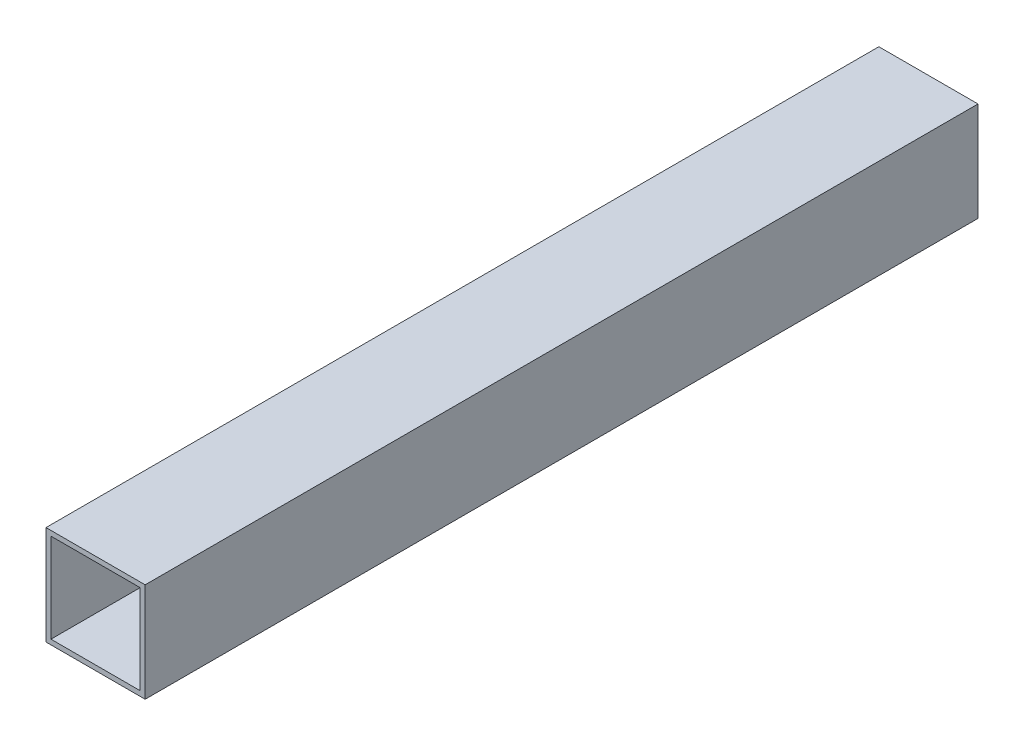
ISO-10303-21;
HEADER;
FILE_DESCRIPTION(('STEP AP214'),'2;1');
FILE_NAME('part.step','',(''),(''),'','','');
FILE_SCHEMA(('AUTOMOTIVE_DESIGN { 1 0 10303 214 1 1 1 1 }'));
ENDSEC;
DATA;
#1=APPLICATION_CONTEXT('core data for automotive mechanical design processes');
#2=APPLICATION_PROTOCOL_DEFINITION('international standard','automotive_design',2000,#1);
#3=PRODUCT_CONTEXT('',#1,'mechanical');
#4=PRODUCT('Part','Part','',(#3));
#5=PRODUCT_RELATED_PRODUCT_CATEGORY('part','',(#4));
#6=PRODUCT_DEFINITION_FORMATION('','',#4);
#7=PRODUCT_DEFINITION_CONTEXT('part definition',#1,'design');
#8=PRODUCT_DEFINITION('design','',#6,#7);
#9=PRODUCT_DEFINITION_SHAPE('','',#8);
#10=(LENGTH_UNIT() NAMED_UNIT(*) SI_UNIT(.MILLI.,.METRE.));
#11=(NAMED_UNIT(*) PLANE_ANGLE_UNIT() SI_UNIT($,.RADIAN.));
#12=(NAMED_UNIT(*) SI_UNIT($,.STERADIAN.) SOLID_ANGLE_UNIT());
#13=UNCERTAINTY_MEASURE_WITH_UNIT(LENGTH_MEASURE(1.E-05),#10,'distance_accuracy_value','');
#14=(GEOMETRIC_REPRESENTATION_CONTEXT(3) GLOBAL_UNCERTAINTY_ASSIGNED_CONTEXT((#13)) GLOBAL_UNIT_ASSIGNED_CONTEXT((#10,
#11,#12)) REPRESENTATION_CONTEXT('',''));
#15=CARTESIAN_POINT('',(0.,0.,0.));
#16=DIRECTION('',(0.,0.,1.));
#17=DIRECTION('',(1.,0.,0.));
#18=AXIS2_PLACEMENT_3D('',#15,#16,#17);
#19=CARTESIAN_POINT('',(0.,0.,420.));
#20=DIRECTION('',(0.,0.,-1.));
#21=DIRECTION('',(-1.,0.,0.));
#22=AXIS2_PLACEMENT_3D('',#19,#20,#21);
#23=PLANE('',#22);
#24=DIRECTION('',(0.,-1.,0.));
#25=VECTOR('',#24,1.);
#26=CARTESIAN_POINT('',(-50.,-50.,420.));
#27=LINE('',#26,#25);
#28=CARTESIAN_POINT('',(-50.,49.9999999999999,420.));
#29=VERTEX_POINT('',#28);
#30=CARTESIAN_POINT('',(-50.,-50.,420.));
#31=VERTEX_POINT('',#30);
#32=EDGE_CURVE('E134',#29,#31,#27,.T.);
#33=ORIENTED_EDGE('',*,*,#32,.T.);
#34=DIRECTION('',(1.,0.,0.));
#35=VECTOR('',#34,1.);
#36=CARTESIAN_POINT('',(-50.,-50.,420.));
#37=LINE('',#36,#35);
#38=CARTESIAN_POINT('',(50.,-50.,420.));
#39=VERTEX_POINT('',#38);
#40=EDGE_CURVE('E137',#31,#39,#37,.T.);
#41=ORIENTED_EDGE('',*,*,#40,.T.);
#42=DIRECTION('',(0.,1.,0.));
#43=VECTOR('',#42,1.);
#44=CARTESIAN_POINT('',(50.,-50.,420.));
#45=LINE('',#44,#43);
#46=CARTESIAN_POINT('',(49.9999999999999,49.9999999999999,420.));
#47=VERTEX_POINT('',#46);
#48=EDGE_CURVE('E140',#39,#47,#45,.T.);
#49=ORIENTED_EDGE('',*,*,#48,.T.);
#50=DIRECTION('',(-1.,0.,0.));
#51=VECTOR('',#50,1.);
#52=CARTESIAN_POINT('',(-50.,49.9999999999999,420.));
#53=LINE('',#52,#51);
#54=EDGE_CURVE('E142',#47,#29,#53,.T.);
#55=ORIENTED_EDGE('',*,*,#54,.T.);
#56=EDGE_LOOP('',(#33,#41,#49,#55));
#57=FACE_BOUND('',#56,.T.);
#58=DIRECTION('',(0.,-1.,0.));
#59=VECTOR('',#58,1.);
#60=CARTESIAN_POINT('',(-45.,-45.,420.));
#61=LINE('',#60,#59);
#62=CARTESIAN_POINT('',(-45.,44.9999999999999,420.));
#63=VERTEX_POINT('',#62);
#64=CARTESIAN_POINT('',(-45.,-45.,420.));
#65=VERTEX_POINT('',#64);
#66=EDGE_CURVE('E98',#63,#65,#61,.T.);
#67=ORIENTED_EDGE('',*,*,#66,.F.);
#68=DIRECTION('',(-1.,0.,0.));
#69=VECTOR('',#68,1.);
#70=CARTESIAN_POINT('',(-45.,44.9999999999999,420.));
#71=LINE('',#70,#69);
#72=CARTESIAN_POINT('',(45.,44.9999999999999,420.));
#73=VERTEX_POINT('',#72);
#74=EDGE_CURVE('E120',#73,#63,#71,.T.);
#75=ORIENTED_EDGE('',*,*,#74,.F.);
#76=DIRECTION('',(0.,1.,0.));
#77=VECTOR('',#76,1.);
#78=CARTESIAN_POINT('',(45.,-45.,420.));
#79=LINE('',#78,#77);
#80=CARTESIAN_POINT('',(45.,-45.,420.));
#81=VERTEX_POINT('',#80);
#82=EDGE_CURVE('E118',#81,#73,#79,.T.);
#83=ORIENTED_EDGE('',*,*,#82,.F.);
#84=DIRECTION('',(1.,0.,0.));
#85=VECTOR('',#84,1.);
#86=CARTESIAN_POINT('',(-45.,-45.,420.));
#87=LINE('',#86,#85);
#88=EDGE_CURVE('E106',#65,#81,#87,.T.);
#89=ORIENTED_EDGE('',*,*,#88,.F.);
#90=EDGE_LOOP('',(#67,#75,#83,#89));
#91=FACE_BOUND('',#90,.T.);
#92=ADVANCED_FACE('F33',(#57,#91),#23,.F.);
#93=CARTESIAN_POINT('',(0.,0.,-420.));
#94=DIRECTION('',(0.,0.,-1.));
#95=DIRECTION('',(-1.,0.,0.));
#96=AXIS2_PLACEMENT_3D('',#93,#94,#95);
#97=PLANE('',#96);
#98=DIRECTION('',(0.,-1.,0.));
#99=VECTOR('',#98,1.);
#100=CARTESIAN_POINT('',(-50.,-50.,-420.));
#101=LINE('',#100,#99);
#102=CARTESIAN_POINT('',(-50.,49.9999999999999,-420.));
#103=VERTEX_POINT('',#102);
#104=CARTESIAN_POINT('',(-50.,-50.,-420.));
#105=VERTEX_POINT('',#104);
#106=EDGE_CURVE('E114',#103,#105,#101,.T.);
#107=ORIENTED_EDGE('',*,*,#106,.F.);
#108=DIRECTION('',(-1.,0.,0.));
#109=VECTOR('',#108,1.);
#110=CARTESIAN_POINT('',(-50.,49.9999999999999,-420.));
#111=LINE('',#110,#109);
#112=CARTESIAN_POINT('',(49.9999999999999,49.9999999999999,-420.));
#113=VERTEX_POINT('',#112);
#114=EDGE_CURVE('E138',#113,#103,#111,.T.);
#115=ORIENTED_EDGE('',*,*,#114,.F.);
#116=DIRECTION('',(0.,1.,0.));
#117=VECTOR('',#116,1.);
#118=CARTESIAN_POINT('',(50.,-50.,-420.));
#119=LINE('',#118,#117);
#120=CARTESIAN_POINT('',(50.,-50.,-420.));
#121=VERTEX_POINT('',#120);
#122=EDGE_CURVE('E149',#121,#113,#119,.T.);
#123=ORIENTED_EDGE('',*,*,#122,.F.);
#124=DIRECTION('',(1.,0.,0.));
#125=VECTOR('',#124,1.);
#126=CARTESIAN_POINT('',(-50.,-50.,-420.));
#127=LINE('',#126,#125);
#128=EDGE_CURVE('E147',#105,#121,#127,.T.);
#129=ORIENTED_EDGE('',*,*,#128,.F.);
#130=EDGE_LOOP('',(#107,#115,#123,#129));
#131=FACE_BOUND('',#130,.T.);
#132=DIRECTION('',(-1.,0.,0.));
#133=VECTOR('',#132,1.);
#134=CARTESIAN_POINT('',(-45.,44.9999999999999,-420.));
#135=LINE('',#134,#133);
#136=CARTESIAN_POINT('',(45.,44.9999999999999,-420.));
#137=VERTEX_POINT('',#136);
#138=CARTESIAN_POINT('',(-45.,44.9999999999999,-420.));
#139=VERTEX_POINT('',#138);
#140=EDGE_CURVE('E107',#137,#139,#135,.T.);
#141=ORIENTED_EDGE('',*,*,#140,.T.);
#142=DIRECTION('',(0.,-1.,0.));
#143=VECTOR('',#142,1.);
#144=CARTESIAN_POINT('',(-45.,-45.,-420.));
#145=LINE('',#144,#143);
#146=CARTESIAN_POINT('',(-45.,-45.,-420.));
#147=VERTEX_POINT('',#146);
#148=EDGE_CURVE('E56',#139,#147,#145,.T.);
#149=ORIENTED_EDGE('',*,*,#148,.T.);
#150=DIRECTION('',(1.,0.,0.));
#151=VECTOR('',#150,1.);
#152=CARTESIAN_POINT('',(-45.,-45.,-420.));
#153=LINE('',#152,#151);
#154=CARTESIAN_POINT('',(45.,-45.,-420.));
#155=VERTEX_POINT('',#154);
#156=EDGE_CURVE('E113',#147,#155,#153,.T.);
#157=ORIENTED_EDGE('',*,*,#156,.T.);
#158=DIRECTION('',(0.,1.,0.));
#159=VECTOR('',#158,1.);
#160=CARTESIAN_POINT('',(45.,-45.,-420.));
#161=LINE('',#160,#159);
#162=EDGE_CURVE('E126',#155,#137,#161,.T.);
#163=ORIENTED_EDGE('',*,*,#162,.T.);
#164=EDGE_LOOP('',(#141,#149,#157,#163));
#165=FACE_BOUND('',#164,.T.);
#166=ADVANCED_FACE('F167',(#131,#165),#97,.T.);
#167=CARTESIAN_POINT('',(-50.,-50.,420.));
#168=DIRECTION('',(1.,0.,0.));
#169=DIRECTION('',(0.,0.,-1.));
#170=AXIS2_PLACEMENT_3D('',#167,#168,#169);
#171=PLANE('',#170);
#172=ORIENTED_EDGE('',*,*,#106,.T.);
#173=DIRECTION('',(0.,0.,-1.));
#174=VECTOR('',#173,1.);
#175=CARTESIAN_POINT('',(-50.,-50.,420.));
#176=LINE('',#175,#174);
#177=EDGE_CURVE('E11',#31,#105,#176,.T.);
#178=ORIENTED_EDGE('',*,*,#177,.F.);
#179=ORIENTED_EDGE('',*,*,#32,.F.);
#180=DIRECTION('',(0.,0.,-1.));
#181=VECTOR('',#180,1.);
#182=CARTESIAN_POINT('',(-50.,49.9999999999999,420.));
#183=LINE('',#182,#181);
#184=EDGE_CURVE('E144',#29,#103,#183,.T.);
#185=ORIENTED_EDGE('',*,*,#184,.T.);
#186=EDGE_LOOP('',(#172,#178,#179,#185));
#187=FACE_BOUND('',#186,.T.);
#188=ADVANCED_FACE('F35',(#187),#171,.F.);
#189=CARTESIAN_POINT('',(-50.,-50.,420.));
#190=DIRECTION('',(0.,1.,0.));
#191=DIRECTION('',(0.,0.,1.));
#192=AXIS2_PLACEMENT_3D('',#189,#190,#191);
#193=PLANE('',#192);
#194=ORIENTED_EDGE('',*,*,#128,.T.);
#195=DIRECTION('',(0.,0.,-1.));
#196=VECTOR('',#195,1.);
#197=CARTESIAN_POINT('',(50.,-50.,420.));
#198=LINE('',#197,#196);
#199=EDGE_CURVE('E41',#39,#121,#198,.T.);
#200=ORIENTED_EDGE('',*,*,#199,.F.);
#201=ORIENTED_EDGE('',*,*,#40,.F.);
#202=ORIENTED_EDGE('',*,*,#177,.T.);
#203=EDGE_LOOP('',(#194,#200,#201,#202));
#204=FACE_BOUND('',#203,.T.);
#205=ADVANCED_FACE('F177',(#204),#193,.F.);
#206=CARTESIAN_POINT('',(50.,-50.,420.));
#207=DIRECTION('',(-1.,0.,0.));
#208=DIRECTION('',(0.,-1.,0.));
#209=AXIS2_PLACEMENT_3D('',#206,#207,#208);
#210=PLANE('',#209);
#211=ORIENTED_EDGE('',*,*,#122,.T.);
#212=DIRECTION('',(0.,0.,-1.));
#213=VECTOR('',#212,1.);
#214=CARTESIAN_POINT('',(49.9999999999999,49.9999999999999,420.));
#215=LINE('',#214,#213);
#216=EDGE_CURVE('E154',#47,#113,#215,.T.);
#217=ORIENTED_EDGE('',*,*,#216,.F.);
#218=ORIENTED_EDGE('',*,*,#48,.F.);
#219=ORIENTED_EDGE('',*,*,#199,.T.);
#220=EDGE_LOOP('',(#211,#217,#218,#219));
#221=FACE_BOUND('',#220,.T.);
#222=ADVANCED_FACE('F161',(#221),#210,.F.);
#223=CARTESIAN_POINT('',(-50.,49.9999999999999,420.));
#224=DIRECTION('',(0.,-1.,0.));
#225=DIRECTION('',(0.,0.,-1.));
#226=AXIS2_PLACEMENT_3D('',#223,#224,#225);
#227=PLANE('',#226);
#228=ORIENTED_EDGE('',*,*,#114,.T.);
#229=ORIENTED_EDGE('',*,*,#184,.F.);
#230=ORIENTED_EDGE('',*,*,#54,.F.);
#231=ORIENTED_EDGE('',*,*,#216,.T.);
#232=EDGE_LOOP('',(#228,#229,#230,#231));
#233=FACE_BOUND('',#232,.T.);
#234=ADVANCED_FACE('F171',(#233),#227,.F.);
#235=CARTESIAN_POINT('',(-45.,-45.,420.));
#236=DIRECTION('',(1.,0.,0.));
#237=DIRECTION('',(0.,0.,-1.));
#238=AXIS2_PLACEMENT_3D('',#235,#236,#237);
#239=PLANE('',#238);
#240=ORIENTED_EDGE('',*,*,#148,.F.);
#241=DIRECTION('',(0.,0.,-1.));
#242=VECTOR('',#241,1.);
#243=CARTESIAN_POINT('',(-45.,44.9999999999999,420.));
#244=LINE('',#243,#242);
#245=EDGE_CURVE('E102',#63,#139,#244,.T.);
#246=ORIENTED_EDGE('',*,*,#245,.F.);
#247=ORIENTED_EDGE('',*,*,#66,.T.);
#248=DIRECTION('',(0.,0.,-1.));
#249=VECTOR('',#248,1.);
#250=CARTESIAN_POINT('',(-45.,-45.,420.));
#251=LINE('',#250,#249);
#252=EDGE_CURVE('E101',#65,#147,#251,.T.);
#253=ORIENTED_EDGE('',*,*,#252,.T.);
#254=EDGE_LOOP('',(#240,#246,#247,#253));
#255=FACE_BOUND('',#254,.T.);
#256=ADVANCED_FACE('F100',(#255),#239,.T.);
#257=CARTESIAN_POINT('',(-45.,-45.,420.));
#258=DIRECTION('',(0.,1.,0.));
#259=DIRECTION('',(0.,0.,1.));
#260=AXIS2_PLACEMENT_3D('',#257,#258,#259);
#261=PLANE('',#260);
#262=ORIENTED_EDGE('',*,*,#156,.F.);
#263=ORIENTED_EDGE('',*,*,#252,.F.);
#264=ORIENTED_EDGE('',*,*,#88,.T.);
#265=DIRECTION('',(0.,0.,-1.));
#266=VECTOR('',#265,1.);
#267=CARTESIAN_POINT('',(45.,-45.,420.));
#268=LINE('',#267,#266);
#269=EDGE_CURVE('E115',#81,#155,#268,.T.);
#270=ORIENTED_EDGE('',*,*,#269,.T.);
#271=EDGE_LOOP('',(#262,#263,#264,#270));
#272=FACE_BOUND('',#271,.T.);
#273=ADVANCED_FACE('F110',(#272),#261,.T.);
#274=CARTESIAN_POINT('',(45.,-45.,420.));
#275=DIRECTION('',(-1.,0.,0.));
#276=DIRECTION('',(0.,-1.,0.));
#277=AXIS2_PLACEMENT_3D('',#274,#275,#276);
#278=PLANE('',#277);
#279=ORIENTED_EDGE('',*,*,#162,.F.);
#280=ORIENTED_EDGE('',*,*,#269,.F.);
#281=ORIENTED_EDGE('',*,*,#82,.T.);
#282=DIRECTION('',(0.,0.,-1.));
#283=VECTOR('',#282,1.);
#284=CARTESIAN_POINT('',(45.,44.9999999999999,420.));
#285=LINE('',#284,#283);
#286=EDGE_CURVE('E48',#73,#137,#285,.T.);
#287=ORIENTED_EDGE('',*,*,#286,.T.);
#288=EDGE_LOOP('',(#279,#280,#281,#287));
#289=FACE_BOUND('',#288,.T.);
#290=ADVANCED_FACE('F200',(#289),#278,.T.);
#291=CARTESIAN_POINT('',(-45.,44.9999999999999,420.));
#292=DIRECTION('',(0.,-1.,0.));
#293=DIRECTION('',(0.,0.,-1.));
#294=AXIS2_PLACEMENT_3D('',#291,#292,#293);
#295=PLANE('',#294);
#296=ORIENTED_EDGE('',*,*,#140,.F.);
#297=ORIENTED_EDGE('',*,*,#286,.F.);
#298=ORIENTED_EDGE('',*,*,#74,.T.);
#299=ORIENTED_EDGE('',*,*,#245,.T.);
#300=EDGE_LOOP('',(#296,#297,#298,#299));
#301=FACE_BOUND('',#300,.T.);
#302=ADVANCED_FACE('F204',(#301),#295,.T.);
#303=CLOSED_SHELL('',(#92,#166,#188,#205,#222,#234,#256,#273,#290,#302));
#304=MANIFOLD_SOLID_BREP('B2',#303);
#305=ADVANCED_BREP_SHAPE_REPRESENTATION('',(#18,#304),#14);
#306=SHAPE_DEFINITION_REPRESENTATION(#9,#305);
ENDSEC;
END-ISO-10303-21;
